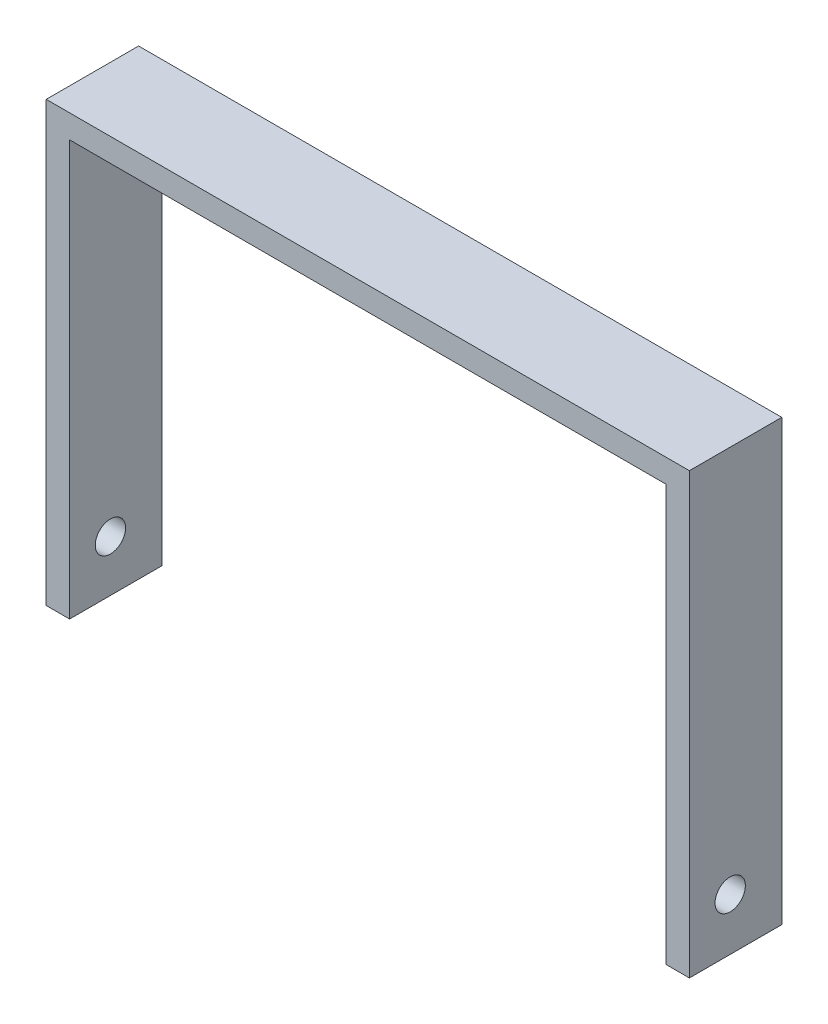
ISO-10303-21;
HEADER;
FILE_DESCRIPTION(('STEP AP214'),'2;1');
FILE_NAME('part.step','',(''),(''),'','','');
FILE_SCHEMA(('AUTOMOTIVE_DESIGN { 1 0 10303 214 1 1 1 1 }'));
ENDSEC;
DATA;
#1=APPLICATION_CONTEXT('core data for automotive mechanical design processes');
#2=APPLICATION_PROTOCOL_DEFINITION('international standard','automotive_design',2000,#1);
#3=PRODUCT_CONTEXT('',#1,'mechanical');
#4=PRODUCT('Part','Part','',(#3));
#5=PRODUCT_RELATED_PRODUCT_CATEGORY('part','',(#4));
#6=PRODUCT_DEFINITION_FORMATION('','',#4);
#7=PRODUCT_DEFINITION_CONTEXT('part definition',#1,'design');
#8=PRODUCT_DEFINITION('design','',#6,#7);
#9=PRODUCT_DEFINITION_SHAPE('','',#8);
#10=(LENGTH_UNIT() NAMED_UNIT(*) SI_UNIT(.MILLI.,.METRE.));
#11=(NAMED_UNIT(*) PLANE_ANGLE_UNIT() SI_UNIT($,.RADIAN.));
#12=(NAMED_UNIT(*) SI_UNIT($,.STERADIAN.) SOLID_ANGLE_UNIT());
#13=UNCERTAINTY_MEASURE_WITH_UNIT(LENGTH_MEASURE(1.E-05),#10,'distance_accuracy_value','');
#14=(GEOMETRIC_REPRESENTATION_CONTEXT(3) GLOBAL_UNCERTAINTY_ASSIGNED_CONTEXT((#13)) GLOBAL_UNIT_ASSIGNED_CONTEXT((#10,
#11,#12)) REPRESENTATION_CONTEXT('',''));
#15=CARTESIAN_POINT('',(0.,0.,0.));
#16=DIRECTION('',(0.,0.,1.));
#17=DIRECTION('',(1.,0.,0.));
#18=AXIS2_PLACEMENT_3D('',#15,#16,#17);
#19=CARTESIAN_POINT('',(109.936518274046,-42.6424648559406,20.066));
#20=DIRECTION('',(-1.,0.,0.));
#21=DIRECTION('',(0.,0.,1.));
#22=AXIS2_PLACEMENT_3D('',#19,#20,#21);
#23=PLANE('',#22);
#24=CARTESIAN_POINT('',(109.936518274046,-31.3353141420293,11.2034318291071));
#25=DIRECTION('',(-1.,0.,0.));
#26=DIRECTION('',(0.,0.,1.));
#27=AXIS2_PLACEMENT_3D('',#24,#25,#26);
#28=CIRCLE('',#27,3.2931623210456);
#29=CARTESIAN_POINT('',(109.936518274046,-31.3353141420293,14.4965941501527));
#30=VERTEX_POINT('',#29);
#31=EDGE_CURVE('E134',#30,#30,#28,.T.);
#32=ORIENTED_EDGE('',*,*,#31,.T.);
#33=EDGE_LOOP('',(#32));
#34=FACE_BOUND('',#33,.T.);
#35=DIRECTION('',(0.,1.,0.));
#36=VECTOR('',#35,1.);
#37=CARTESIAN_POINT('',(109.936518274046,-42.6424648559406,0.));
#38=LINE('',#37,#36);
#39=CARTESIAN_POINT('',(109.936518274046,-42.6424648559406,0.));
#40=VERTEX_POINT('',#39);
#41=CARTESIAN_POINT('',(109.936518274046,52.7874854697807,0.));
#42=VERTEX_POINT('',#41);
#43=EDGE_CURVE('E130',#40,#42,#38,.T.);
#44=ORIENTED_EDGE('',*,*,#43,.T.);
#45=DIRECTION('',(0.,0.,-1.));
#46=VECTOR('',#45,1.);
#47=CARTESIAN_POINT('',(109.936518274046,52.7874854697807,20.066));
#48=LINE('',#47,#46);
#49=CARTESIAN_POINT('',(109.936518274046,52.7874854697807,20.066));
#50=VERTEX_POINT('',#49);
#51=EDGE_CURVE('E11',#50,#42,#48,.T.);
#52=ORIENTED_EDGE('',*,*,#51,.F.);
#53=DIRECTION('',(0.,1.,0.));
#54=VECTOR('',#53,1.);
#55=CARTESIAN_POINT('',(109.936518274046,-42.6424648559406,20.066));
#56=LINE('',#55,#54);
#57=CARTESIAN_POINT('',(109.936518274046,-42.6424648559406,20.066));
#58=VERTEX_POINT('',#57);
#59=EDGE_CURVE('E145',#58,#50,#56,.T.);
#60=ORIENTED_EDGE('',*,*,#59,.F.);
#61=DIRECTION('',(0.,0.,-1.));
#62=VECTOR('',#61,1.);
#63=CARTESIAN_POINT('',(109.936518274046,-42.6424648559406,20.066));
#64=LINE('',#63,#62);
#65=EDGE_CURVE('E126',#58,#40,#64,.T.);
#66=ORIENTED_EDGE('',*,*,#65,.T.);
#67=EDGE_LOOP('',(#44,#52,#60,#66));
#68=FACE_BOUND('',#67,.T.);
#69=ADVANCED_FACE('F33',(#34,#68),#23,.F.);
#70=CARTESIAN_POINT('',(109.936518274046,52.7874854697807,20.066));
#71=DIRECTION('',(0.,-1.,0.));
#72=DIRECTION('',(1.,0.,0.));
#73=AXIS2_PLACEMENT_3D('',#70,#71,#72);
#74=PLANE('',#73);
#75=DIRECTION('',(-1.,0.,0.));
#76=VECTOR('',#75,1.);
#77=CARTESIAN_POINT('',(109.936518274046,52.7874854697807,0.));
#78=LINE('',#77,#76);
#79=CARTESIAN_POINT('',(-29.7634817259535,52.7874854697807,0.));
#80=VERTEX_POINT('',#79);
#81=EDGE_CURVE('E133',#42,#80,#78,.T.);
#82=ORIENTED_EDGE('',*,*,#81,.T.);
#83=DIRECTION('',(0.,0.,-1.));
#84=VECTOR('',#83,1.);
#85=CARTESIAN_POINT('',(-29.7634817259535,52.7874854697807,20.066));
#86=LINE('',#85,#84);
#87=CARTESIAN_POINT('',(-29.7634817259535,52.7874854697807,20.066));
#88=VERTEX_POINT('',#87);
#89=EDGE_CURVE('E42',#88,#80,#86,.T.);
#90=ORIENTED_EDGE('',*,*,#89,.F.);
#91=DIRECTION('',(-1.,0.,0.));
#92=VECTOR('',#91,1.);
#93=CARTESIAN_POINT('',(109.936518274046,52.7874854697807,20.066));
#94=LINE('',#93,#92);
#95=EDGE_CURVE('E93',#50,#88,#94,.T.);
#96=ORIENTED_EDGE('',*,*,#95,.F.);
#97=ORIENTED_EDGE('',*,*,#51,.T.);
#98=EDGE_LOOP('',(#82,#90,#96,#97));
#99=FACE_BOUND('',#98,.T.);
#100=ADVANCED_FACE('F201',(#99),#74,.F.);
#101=CARTESIAN_POINT('',(-29.7634817259535,52.7874854697807,20.066));
#102=DIRECTION('',(1.,0.,0.));
#103=DIRECTION('',(0.,1.,0.));
#104=AXIS2_PLACEMENT_3D('',#101,#102,#103);
#105=PLANE('',#104);
#106=CARTESIAN_POINT('',(-29.7634817259535,-31.3353141420293,11.2034318291071));
#107=DIRECTION('',(-1.,0.,0.));
#108=DIRECTION('',(0.,-1.,0.));
#109=AXIS2_PLACEMENT_3D('',#106,#107,#108);
#110=CIRCLE('',#109,3.2931623210456);
#111=CARTESIAN_POINT('',(-29.7634817259535,-34.6284764630749,11.2034318291071));
#112=VERTEX_POINT('',#111);
#113=EDGE_CURVE('E184',#112,#112,#110,.T.);
#114=ORIENTED_EDGE('',*,*,#113,.F.);
#115=EDGE_LOOP('',(#114));
#116=FACE_BOUND('',#115,.T.);
#117=DIRECTION('',(0.,-1.,0.));
#118=VECTOR('',#117,1.);
#119=CARTESIAN_POINT('',(-29.7634817259535,52.7874854697807,0.));
#120=LINE('',#119,#118);
#121=CARTESIAN_POINT('',(-29.7634817259535,-42.434997301386,0.));
#122=VERTEX_POINT('',#121);
#123=EDGE_CURVE('E136',#80,#122,#120,.T.);
#124=ORIENTED_EDGE('',*,*,#123,.T.);
#125=DIRECTION('',(0.,0.,-1.));
#126=VECTOR('',#125,1.);
#127=CARTESIAN_POINT('',(-29.7634817259535,-42.434997301386,20.066));
#128=LINE('',#127,#126);
#129=CARTESIAN_POINT('',(-29.7634817259535,-42.434997301386,20.066));
#130=VERTEX_POINT('',#129);
#131=EDGE_CURVE('E152',#130,#122,#128,.T.);
#132=ORIENTED_EDGE('',*,*,#131,.F.);
#133=DIRECTION('',(0.,-1.,0.));
#134=VECTOR('',#133,1.);
#135=CARTESIAN_POINT('',(-29.7634817259535,52.7874854697807,20.066));
#136=LINE('',#135,#134);
#137=EDGE_CURVE('E161',#88,#130,#136,.T.);
#138=ORIENTED_EDGE('',*,*,#137,.F.);
#139=ORIENTED_EDGE('',*,*,#89,.T.);
#140=EDGE_LOOP('',(#124,#132,#138,#139));
#141=FACE_BOUND('',#140,.T.);
#142=ADVANCED_FACE('F159',(#116,#141),#105,.F.);
#143=CARTESIAN_POINT('',(-29.7634817259535,-42.434997301386,20.066));
#144=DIRECTION('',(0.,1.,0.));
#145=DIRECTION('',(0.,0.,1.));
#146=AXIS2_PLACEMENT_3D('',#143,#144,#145);
#147=PLANE('',#146);
#148=DIRECTION('',(1.,0.,0.));
#149=VECTOR('',#148,1.);
#150=CARTESIAN_POINT('',(-29.7634817259535,-42.434997301386,0.));
#151=LINE('',#150,#149);
#152=CARTESIAN_POINT('',(-24.6834817259535,-42.434997301386,0.));
#153=VERTEX_POINT('',#152);
#154=EDGE_CURVE('E138',#122,#153,#151,.T.);
#155=ORIENTED_EDGE('',*,*,#154,.T.);
#156=DIRECTION('',(0.,0.,-1.));
#157=VECTOR('',#156,1.);
#158=CARTESIAN_POINT('',(-24.6834817259535,-42.434997301386,20.066));
#159=LINE('',#158,#157);
#160=CARTESIAN_POINT('',(-24.6834817259535,-42.434997301386,20.066));
#161=VERTEX_POINT('',#160);
#162=EDGE_CURVE('E149',#161,#153,#159,.T.);
#163=ORIENTED_EDGE('',*,*,#162,.F.);
#164=DIRECTION('',(1.,0.,0.));
#165=VECTOR('',#164,1.);
#166=CARTESIAN_POINT('',(-29.7634817259535,-42.434997301386,20.066));
#167=LINE('',#166,#165);
#168=EDGE_CURVE('E173',#130,#161,#167,.T.);
#169=ORIENTED_EDGE('',*,*,#168,.F.);
#170=ORIENTED_EDGE('',*,*,#131,.T.);
#171=EDGE_LOOP('',(#155,#163,#169,#170));
#172=FACE_BOUND('',#171,.T.);
#173=ADVANCED_FACE('F169',(#172),#147,.F.);
#174=CARTESIAN_POINT('',(-24.6834817259535,-42.434997301386,20.066));
#175=DIRECTION('',(-1.,0.,0.));
#176=DIRECTION('',(0.,0.,1.));
#177=AXIS2_PLACEMENT_3D('',#174,#175,#176);
#178=PLANE('',#177);
#179=CARTESIAN_POINT('',(-24.6834817259535,-31.3353141420293,11.2034318291071));
#180=DIRECTION('',(-1.,0.,0.));
#181=DIRECTION('',(0.,0.,1.));
#182=AXIS2_PLACEMENT_3D('',#179,#180,#181);
#183=CIRCLE('',#182,3.2931623210456);
#184=CARTESIAN_POINT('',(-24.6834817259535,-31.3353141420293,14.4965941501527));
#185=VERTEX_POINT('',#184);
#186=EDGE_CURVE('E181',#185,#185,#183,.T.);
#187=ORIENTED_EDGE('',*,*,#186,.T.);
#188=EDGE_LOOP('',(#187));
#189=FACE_BOUND('',#188,.T.);
#190=DIRECTION('',(0.,1.,0.));
#191=VECTOR('',#190,1.);
#192=CARTESIAN_POINT('',(-24.6834817259535,-42.434997301386,0.));
#193=LINE('',#192,#191);
#194=CARTESIAN_POINT('',(-24.6834817259535,47.7074854697807,0.));
#195=VERTEX_POINT('',#194);
#196=EDGE_CURVE('E140',#153,#195,#193,.T.);
#197=ORIENTED_EDGE('',*,*,#196,.T.);
#198=DIRECTION('',(0.,0.,-1.));
#199=VECTOR('',#198,1.);
#200=CARTESIAN_POINT('',(-24.6834817259535,47.7074854697807,20.066));
#201=LINE('',#200,#199);
#202=CARTESIAN_POINT('',(-24.6834817259535,47.7074854697807,20.066));
#203=VERTEX_POINT('',#202);
#204=EDGE_CURVE('E121',#203,#195,#201,.T.);
#205=ORIENTED_EDGE('',*,*,#204,.F.);
#206=DIRECTION('',(0.,1.,0.));
#207=VECTOR('',#206,1.);
#208=CARTESIAN_POINT('',(-24.6834817259535,-42.434997301386,20.066));
#209=LINE('',#208,#207);
#210=EDGE_CURVE('E112',#161,#203,#209,.T.);
#211=ORIENTED_EDGE('',*,*,#210,.F.);
#212=ORIENTED_EDGE('',*,*,#162,.T.);
#213=EDGE_LOOP('',(#197,#205,#211,#212));
#214=FACE_BOUND('',#213,.T.);
#215=ADVANCED_FACE('F172',(#189,#214),#178,.F.);
#216=CARTESIAN_POINT('',(-24.6834817259535,47.7074854697807,20.066));
#217=DIRECTION('',(0.,1.,0.));
#218=DIRECTION('',(-1.,0.,0.));
#219=AXIS2_PLACEMENT_3D('',#216,#217,#218);
#220=PLANE('',#219);
#221=DIRECTION('',(1.,0.,0.));
#222=VECTOR('',#221,1.);
#223=CARTESIAN_POINT('',(-24.6834817259535,47.7074854697807,0.));
#224=LINE('',#223,#222);
#225=CARTESIAN_POINT('',(104.856518274046,47.7074854697807,0.));
#226=VERTEX_POINT('',#225);
#227=EDGE_CURVE('E120',#195,#226,#224,.T.);
#228=ORIENTED_EDGE('',*,*,#227,.T.);
#229=DIRECTION('',(0.,0.,-1.));
#230=VECTOR('',#229,1.);
#231=CARTESIAN_POINT('',(104.856518274046,47.7074854697807,20.066));
#232=LINE('',#231,#230);
#233=CARTESIAN_POINT('',(104.856518274046,47.7074854697807,20.066));
#234=VERTEX_POINT('',#233);
#235=EDGE_CURVE('E117',#234,#226,#232,.T.);
#236=ORIENTED_EDGE('',*,*,#235,.F.);
#237=DIRECTION('',(1.,0.,0.));
#238=VECTOR('',#237,1.);
#239=CARTESIAN_POINT('',(-24.6834817259535,47.7074854697807,20.066));
#240=LINE('',#239,#238);
#241=EDGE_CURVE('E106',#203,#234,#240,.T.);
#242=ORIENTED_EDGE('',*,*,#241,.F.);
#243=ORIENTED_EDGE('',*,*,#204,.T.);
#244=EDGE_LOOP('',(#228,#236,#242,#243));
#245=FACE_BOUND('',#244,.T.);
#246=ADVANCED_FACE('F118',(#245),#220,.F.);
#247=CARTESIAN_POINT('',(104.856518274046,47.7074854697807,20.066));
#248=DIRECTION('',(1.,0.,0.));
#249=DIRECTION('',(0.,1.,0.));
#250=AXIS2_PLACEMENT_3D('',#247,#248,#249);
#251=PLANE('',#250);
#252=CARTESIAN_POINT('',(104.856518274046,-31.3353141420293,11.2034318291071));
#253=DIRECTION('',(1.,0.,0.));
#254=DIRECTION('',(0.,1.,0.));
#255=AXIS2_PLACEMENT_3D('',#252,#253,#254);
#256=CIRCLE('',#255,3.2931623210456);
#257=CARTESIAN_POINT('',(104.856518274046,-28.0421518209837,11.2034318291071));
#258=VERTEX_POINT('',#257);
#259=EDGE_CURVE('E36',#258,#258,#256,.T.);
#260=ORIENTED_EDGE('',*,*,#259,.T.);
#261=EDGE_LOOP('',(#260));
#262=FACE_BOUND('',#261,.T.);
#263=DIRECTION('',(0.,-1.,0.));
#264=VECTOR('',#263,1.);
#265=CARTESIAN_POINT('',(104.856518274046,47.7074854697807,0.));
#266=LINE('',#265,#264);
#267=CARTESIAN_POINT('',(104.856518274046,-42.6424648559406,0.));
#268=VERTEX_POINT('',#267);
#269=EDGE_CURVE('E79',#226,#268,#266,.T.);
#270=ORIENTED_EDGE('',*,*,#269,.T.);
#271=DIRECTION('',(0.,0.,-1.));
#272=VECTOR('',#271,1.);
#273=CARTESIAN_POINT('',(104.856518274046,-42.6424648559406,20.066));
#274=LINE('',#273,#272);
#275=CARTESIAN_POINT('',(104.856518274046,-42.6424648559406,20.066));
#276=VERTEX_POINT('',#275);
#277=EDGE_CURVE('E122',#276,#268,#274,.T.);
#278=ORIENTED_EDGE('',*,*,#277,.F.);
#279=DIRECTION('',(0.,-1.,0.));
#280=VECTOR('',#279,1.);
#281=CARTESIAN_POINT('',(104.856518274046,47.7074854697807,20.066));
#282=LINE('',#281,#280);
#283=EDGE_CURVE('E110',#234,#276,#282,.T.);
#284=ORIENTED_EDGE('',*,*,#283,.F.);
#285=ORIENTED_EDGE('',*,*,#235,.T.);
#286=EDGE_LOOP('',(#270,#278,#284,#285));
#287=FACE_BOUND('',#286,.T.);
#288=ADVANCED_FACE('F124',(#262,#287),#251,.F.);
#289=CARTESIAN_POINT('',(104.856518274046,-42.6424648559406,20.066));
#290=DIRECTION('',(0.,1.,0.));
#291=DIRECTION('',(-1.,0.,0.));
#292=AXIS2_PLACEMENT_3D('',#289,#290,#291);
#293=PLANE('',#292);
#294=DIRECTION('',(1.,0.,0.));
#295=VECTOR('',#294,1.);
#296=CARTESIAN_POINT('',(104.856518274046,-42.6424648559406,0.));
#297=LINE('',#296,#295);
#298=EDGE_CURVE('E85',#268,#40,#297,.T.);
#299=ORIENTED_EDGE('',*,*,#298,.T.);
#300=ORIENTED_EDGE('',*,*,#65,.F.);
#301=DIRECTION('',(1.,0.,0.));
#302=VECTOR('',#301,1.);
#303=CARTESIAN_POINT('',(104.856518274046,-42.6424648559406,20.066));
#304=LINE('',#303,#302);
#305=EDGE_CURVE('E50',#276,#58,#304,.T.);
#306=ORIENTED_EDGE('',*,*,#305,.F.);
#307=ORIENTED_EDGE('',*,*,#277,.T.);
#308=EDGE_LOOP('',(#299,#300,#306,#307));
#309=FACE_BOUND('',#308,.T.);
#310=ADVANCED_FACE('F204',(#309),#293,.F.);
#311=CARTESIAN_POINT('',(0.,0.,20.066));
#312=DIRECTION('',(0.,0.,1.));
#313=DIRECTION('',(1.,0.,0.));
#314=AXIS2_PLACEMENT_3D('',#311,#312,#313);
#315=PLANE('',#314);
#316=ORIENTED_EDGE('',*,*,#59,.T.);
#317=ORIENTED_EDGE('',*,*,#95,.T.);
#318=ORIENTED_EDGE('',*,*,#137,.T.);
#319=ORIENTED_EDGE('',*,*,#168,.T.);
#320=ORIENTED_EDGE('',*,*,#210,.T.);
#321=ORIENTED_EDGE('',*,*,#241,.T.);
#322=ORIENTED_EDGE('',*,*,#283,.T.);
#323=ORIENTED_EDGE('',*,*,#305,.T.);
#324=EDGE_LOOP('',(#316,#317,#318,#319,#320,#321,#322,#323));
#325=FACE_BOUND('',#324,.T.);
#326=ADVANCED_FACE('F108',(#325),#315,.T.);
#327=CARTESIAN_POINT('',(0.,0.,0.));
#328=DIRECTION('',(0.,0.,1.));
#329=DIRECTION('',(1.,0.,0.));
#330=AXIS2_PLACEMENT_3D('',#327,#328,#329);
#331=PLANE('',#330);
#332=ORIENTED_EDGE('',*,*,#43,.F.);
#333=ORIENTED_EDGE('',*,*,#298,.F.);
#334=ORIENTED_EDGE('',*,*,#269,.F.);
#335=ORIENTED_EDGE('',*,*,#227,.F.);
#336=ORIENTED_EDGE('',*,*,#196,.F.);
#337=ORIENTED_EDGE('',*,*,#154,.F.);
#338=ORIENTED_EDGE('',*,*,#123,.F.);
#339=ORIENTED_EDGE('',*,*,#81,.F.);
#340=EDGE_LOOP('',(#332,#333,#334,#335,#336,#337,#338,#339));
#341=FACE_BOUND('',#340,.T.);
#342=ADVANCED_FACE('F165',(#341),#331,.F.);
#343=CARTESIAN_POINT('',(151.846518274047,-31.3353141420293,11.2034318291071));
#344=DIRECTION('',(-1.,0.,0.));
#345=DIRECTION('',(0.,-1.,0.));
#346=AXIS2_PLACEMENT_3D('',#343,#344,#345);
#347=CYLINDRICAL_SURFACE('',#346,3.2931623210456);
#348=ORIENTED_EDGE('',*,*,#259,.F.);
#349=EDGE_LOOP('',(#348));
#350=FACE_BOUND('',#349,.T.);
#351=ORIENTED_EDGE('',*,*,#31,.F.);
#352=EDGE_LOOP('',(#351));
#353=FACE_BOUND('',#352,.T.);
#354=ADVANCED_FACE('F192',(#350,#353),#347,.F.);
#355=ORIENTED_EDGE('',*,*,#113,.T.);
#356=EDGE_LOOP('',(#355));
#357=FACE_BOUND('',#356,.T.);
#358=ORIENTED_EDGE('',*,*,#186,.F.);
#359=EDGE_LOOP('',(#358));
#360=FACE_BOUND('',#359,.T.);
#361=ADVANCED_FACE('F195',(#357,#360),#347,.F.);
#362=CLOSED_SHELL('',(#69,#100,#142,#173,#215,#246,#288,#310,#326,#342,#354,#361));
#363=MANIFOLD_SOLID_BREP('B2',#362);
#364=ADVANCED_BREP_SHAPE_REPRESENTATION('',(#18,#363),#14);
#365=SHAPE_DEFINITION_REPRESENTATION(#9,#364);
ENDSEC;
END-ISO-10303-21;
